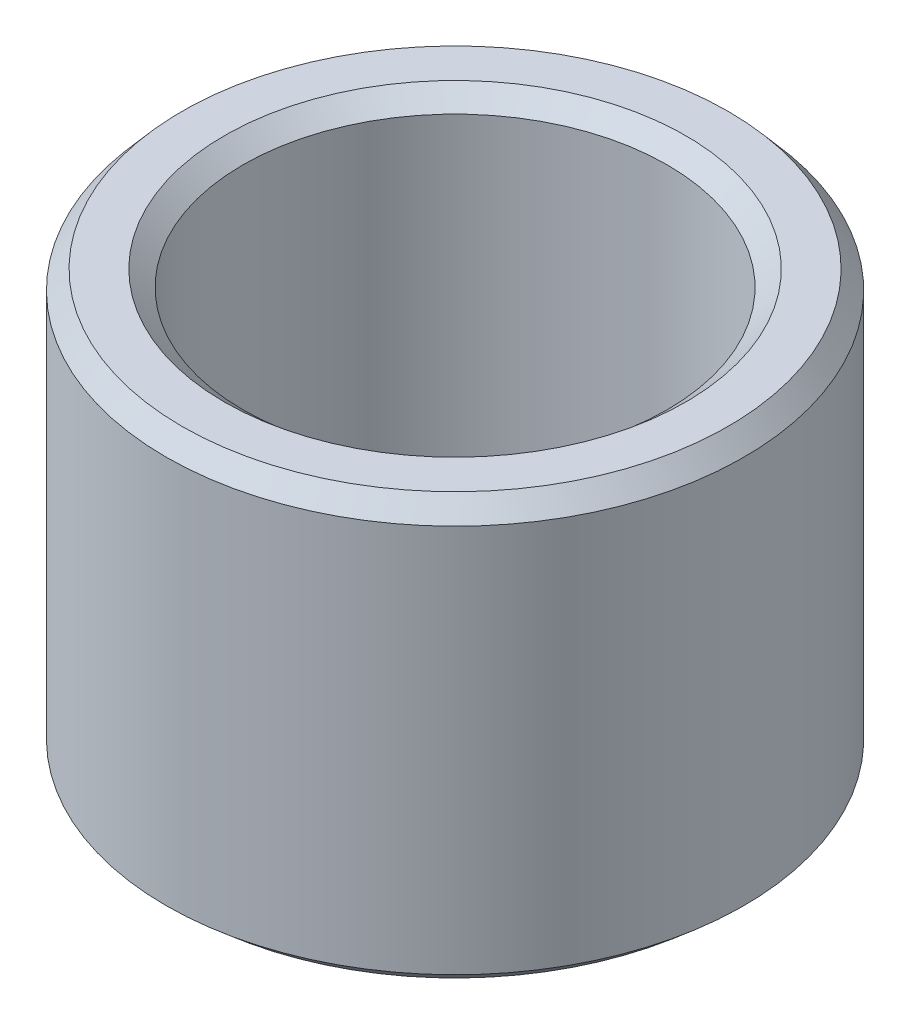
ISO-10303-21;
HEADER;
FILE_DESCRIPTION(('STEP AP214'),'2;1');
FILE_NAME('part.step','',(''),(''),'','','');
FILE_SCHEMA(('AUTOMOTIVE_DESIGN { 1 0 10303 214 1 1 1 1 }'));
ENDSEC;
DATA;
#1=APPLICATION_CONTEXT('core data for automotive mechanical design processes');
#2=APPLICATION_PROTOCOL_DEFINITION('international standard','automotive_design',2000,#1);
#3=PRODUCT_CONTEXT('',#1,'mechanical');
#4=PRODUCT('Part','Part','',(#3));
#5=PRODUCT_RELATED_PRODUCT_CATEGORY('part','',(#4));
#6=PRODUCT_DEFINITION_FORMATION('','',#4);
#7=PRODUCT_DEFINITION_CONTEXT('part definition',#1,'design');
#8=PRODUCT_DEFINITION('design','',#6,#7);
#9=PRODUCT_DEFINITION_SHAPE('','',#8);
#10=(LENGTH_UNIT() NAMED_UNIT(*) SI_UNIT(.MILLI.,.METRE.));
#11=(NAMED_UNIT(*) PLANE_ANGLE_UNIT() SI_UNIT($,.RADIAN.));
#12=(NAMED_UNIT(*) SI_UNIT($,.STERADIAN.) SOLID_ANGLE_UNIT());
#13=UNCERTAINTY_MEASURE_WITH_UNIT(LENGTH_MEASURE(1.E-05),#10,'distance_accuracy_value','');
#14=(GEOMETRIC_REPRESENTATION_CONTEXT(3) GLOBAL_UNCERTAINTY_ASSIGNED_CONTEXT((#13)) GLOBAL_UNIT_ASSIGNED_CONTEXT((#10,
#11,#12)) REPRESENTATION_CONTEXT('',''));
#15=CARTESIAN_POINT('',(0.,0.,0.));
#16=DIRECTION('',(0.,0.,1.));
#17=DIRECTION('',(1.,0.,0.));
#18=AXIS2_PLACEMENT_3D('',#15,#16,#17);
#19=CARTESIAN_POINT('',(0.,80.5076225060649,0.));
#20=DIRECTION('',(0.,-1.,0.));
#21=DIRECTION('',(0.,0.,-1.));
#22=AXIS2_PLACEMENT_3D('',#19,#20,#21);
#23=CYLINDRICAL_SURFACE('',#22,55.);
#24=CARTESIAN_POINT('',(0.,3.04125028081775,0.));
#25=DIRECTION('',(0.,1.,0.));
#26=DIRECTION('',(0.,0.,1.));
#27=AXIS2_PLACEMENT_3D('',#24,#25,#26);
#28=CIRCLE('',#27,55.);
#29=CARTESIAN_POINT('',(0.,3.04125028081775,55.));
#30=VERTEX_POINT('',#29);
#31=EDGE_CURVE('E10',#30,#30,#28,.T.);
#32=ORIENTED_EDGE('',*,*,#31,.T.);
#33=EDGE_LOOP('',(#32));
#34=FACE_BOUND('',#33,.T.);
#35=CARTESIAN_POINT('',(0.,76.9725595382923,0.));
#36=DIRECTION('',(0.,1.,0.));
#37=DIRECTION('',(0.,0.,1.));
#38=AXIS2_PLACEMENT_3D('',#35,#36,#37);
#39=CIRCLE('',#38,55.);
#40=CARTESIAN_POINT('',(0.,76.9725595382923,55.));
#41=VERTEX_POINT('',#40);
#42=EDGE_CURVE('E50',#41,#41,#39,.F.);
#43=ORIENTED_EDGE('',*,*,#42,.T.);
#44=EDGE_LOOP('',(#43));
#45=FACE_BOUND('',#44,.T.);
#46=ADVANCED_FACE('F39',(#34,#45),#23,.T.);
#47=CARTESIAN_POINT('',(0.,80.5076225060649,0.));
#48=DIRECTION('',(0.,1.,0.));
#49=DIRECTION('',(0.,0.,1.));
#50=AXIS2_PLACEMENT_3D('',#47,#48,#49);
#51=PLANE('',#50);
#52=CARTESIAN_POINT('',(0.,80.5076225060649,0.));
#53=DIRECTION('',(0.,1.,0.));
#54=DIRECTION('',(0.,0.,1.));
#55=AXIS2_PLACEMENT_3D('',#52,#53,#54);
#56=CIRCLE('',#55,43.913799009246);
#57=CARTESIAN_POINT('',(0.,80.5076225060649,43.913799009246));
#58=VERTEX_POINT('',#57);
#59=EDGE_CURVE('E58',#58,#58,#56,.F.);
#60=ORIENTED_EDGE('',*,*,#59,.T.);
#61=EDGE_LOOP('',(#60));
#62=FACE_BOUND('',#61,.T.);
#63=CARTESIAN_POINT('',(0.,80.5076225060649,0.));
#64=DIRECTION('',(0.,1.,0.));
#65=DIRECTION('',(0.,0.,1.));
#66=AXIS2_PLACEMENT_3D('',#63,#64,#65);
#67=CIRCLE('',#66,51.9587497191823);
#68=CARTESIAN_POINT('',(0.,80.5076225060649,51.9587497191823));
#69=VERTEX_POINT('',#68);
#70=EDGE_CURVE('E61',#69,#69,#67,.T.);
#71=ORIENTED_EDGE('',*,*,#70,.T.);
#72=EDGE_LOOP('',(#71));
#73=FACE_BOUND('',#72,.T.);
#74=ADVANCED_FACE('F88',(#62,#73),#51,.T.);
#75=CARTESIAN_POINT('',(0.,0.,0.));
#76=DIRECTION('',(0.,1.,0.));
#77=DIRECTION('',(0.,0.,1.));
#78=AXIS2_PLACEMENT_3D('',#75,#76,#77);
#79=PLANE('',#78);
#80=CARTESIAN_POINT('',(0.,0.,0.));
#81=DIRECTION('',(0.,1.,0.));
#82=DIRECTION('',(0.,0.,1.));
#83=AXIS2_PLACEMENT_3D('',#80,#81,#82);
#84=CIRCLE('',#83,43.4199863222911);
#85=CARTESIAN_POINT('',(0.,0.,43.4199863222911));
#86=VERTEX_POINT('',#85);
#87=EDGE_CURVE('E51',#86,#86,#84,.T.);
#88=ORIENTED_EDGE('',*,*,#87,.T.);
#89=EDGE_LOOP('',(#88));
#90=FACE_BOUND('',#89,.T.);
#91=CARTESIAN_POINT('',(0.,0.,0.));
#92=DIRECTION('',(0.,1.,0.));
#93=DIRECTION('',(0.,0.,1.));
#94=AXIS2_PLACEMENT_3D('',#91,#92,#93);
#95=CIRCLE('',#94,51.4649370322273);
#96=CARTESIAN_POINT('',(0.,0.,51.4649370322273));
#97=VERTEX_POINT('',#96);
#98=EDGE_CURVE('E54',#97,#97,#95,.F.);
#99=ORIENTED_EDGE('',*,*,#98,.T.);
#100=EDGE_LOOP('',(#99));
#101=FACE_BOUND('',#100,.T.);
#102=ADVANCED_FACE('F83',(#90,#101),#79,.F.);
#103=CARTESIAN_POINT('',(0.,80.5076225060649,0.));
#104=DIRECTION('',(0.,-1.,0.));
#105=DIRECTION('',(0.,0.,-1.));
#106=AXIS2_PLACEMENT_3D('',#103,#104,#105);
#107=CYLINDRICAL_SURFACE('',#106,40.3787360414734);
#108=CARTESIAN_POINT('',(0.,77.4663722252472,0.));
#109=DIRECTION('',(0.,1.,0.));
#110=DIRECTION('',(0.,0.,1.));
#111=AXIS2_PLACEMENT_3D('',#108,#109,#110);
#112=CIRCLE('',#111,40.3787360414734);
#113=CARTESIAN_POINT('',(0.,77.4663722252472,40.3787360414734));
#114=VERTEX_POINT('',#113);
#115=EDGE_CURVE('E67',#114,#114,#112,.T.);
#116=ORIENTED_EDGE('',*,*,#115,.T.);
#117=EDGE_LOOP('',(#116));
#118=FACE_BOUND('',#117,.T.);
#119=CARTESIAN_POINT('',(0.,3.53506296777269,0.));
#120=DIRECTION('',(0.,1.,0.));
#121=DIRECTION('',(0.,0.,1.));
#122=AXIS2_PLACEMENT_3D('',#119,#120,#121);
#123=CIRCLE('',#122,40.3787360414734);
#124=CARTESIAN_POINT('',(0.,3.53506296777269,40.3787360414734));
#125=VERTEX_POINT('',#124);
#126=EDGE_CURVE('E69',#125,#125,#123,.F.);
#127=ORIENTED_EDGE('',*,*,#126,.T.);
#128=EDGE_LOOP('',(#127));
#129=FACE_BOUND('',#128,.T.);
#130=ADVANCED_FACE('F71',(#118,#129),#107,.F.);
#131=CARTESIAN_POINT('',(0.,77.4663722252472,0.));
#132=DIRECTION('',(0.,1.,0.));
#133=DIRECTION('',(0.,0.,1.));
#134=AXIS2_PLACEMENT_3D('',#131,#132,#133);
#135=CONICAL_SURFACE('',#134,40.3787360414734,0.86034710262467);
#136=ORIENTED_EDGE('',*,*,#59,.F.);
#137=EDGE_LOOP('',(#136));
#138=FACE_BOUND('',#137,.T.);
#139=ORIENTED_EDGE('',*,*,#115,.F.);
#140=EDGE_LOOP('',(#139));
#141=FACE_BOUND('',#140,.T.);
#142=ADVANCED_FACE('F77',(#138,#141),#135,.F.);
#143=CARTESIAN_POINT('',(0.,0.,0.));
#144=DIRECTION('',(0.,-1.,0.));
#145=DIRECTION('',(0.,0.,-1.));
#146=AXIS2_PLACEMENT_3D('',#143,#144,#145);
#147=CONICAL_SURFACE('',#146,43.4199863222911,0.710449224170225);
#148=ORIENTED_EDGE('',*,*,#126,.F.);
#149=EDGE_LOOP('',(#148));
#150=FACE_BOUND('',#149,.T.);
#151=ORIENTED_EDGE('',*,*,#87,.F.);
#152=EDGE_LOOP('',(#151));
#153=FACE_BOUND('',#152,.T.);
#154=ADVANCED_FACE('F73',(#150,#153),#147,.F.);
#155=CARTESIAN_POINT('',(0.,3.04125028081775,0.));
#156=DIRECTION('',(0.,1.,0.));
#157=DIRECTION('',(0.,0.,1.));
#158=AXIS2_PLACEMENT_3D('',#155,#156,#157);
#159=CONICAL_SURFACE('',#158,55.,0.860347102624673);
#160=ORIENTED_EDGE('',*,*,#98,.F.);
#161=EDGE_LOOP('',(#160));
#162=FACE_BOUND('',#161,.T.);
#163=ORIENTED_EDGE('',*,*,#31,.F.);
#164=EDGE_LOOP('',(#163));
#165=FACE_BOUND('',#164,.T.);
#166=ADVANCED_FACE('F76',(#162,#165),#159,.T.);
#167=CARTESIAN_POINT('',(0.,80.5076225060649,0.));
#168=DIRECTION('',(0.,-1.,0.));
#169=DIRECTION('',(0.,0.,-1.));
#170=AXIS2_PLACEMENT_3D('',#167,#168,#169);
#171=CONICAL_SURFACE('',#170,51.9587497191823,0.710449224170224);
#172=ORIENTED_EDGE('',*,*,#42,.F.);
#173=EDGE_LOOP('',(#172));
#174=FACE_BOUND('',#173,.T.);
#175=ORIENTED_EDGE('',*,*,#70,.F.);
#176=EDGE_LOOP('',(#175));
#177=FACE_BOUND('',#176,.T.);
#178=ADVANCED_FACE('F45',(#174,#177),#171,.T.);
#179=CLOSED_SHELL('',(#46,#74,#102,#130,#142,#154,#166,#178));
#180=MANIFOLD_SOLID_BREP('B2',#179);
#181=ADVANCED_BREP_SHAPE_REPRESENTATION('',(#18,#180),#14);
#182=SHAPE_DEFINITION_REPRESENTATION(#9,#181);
ENDSEC;
END-ISO-10303-21;
